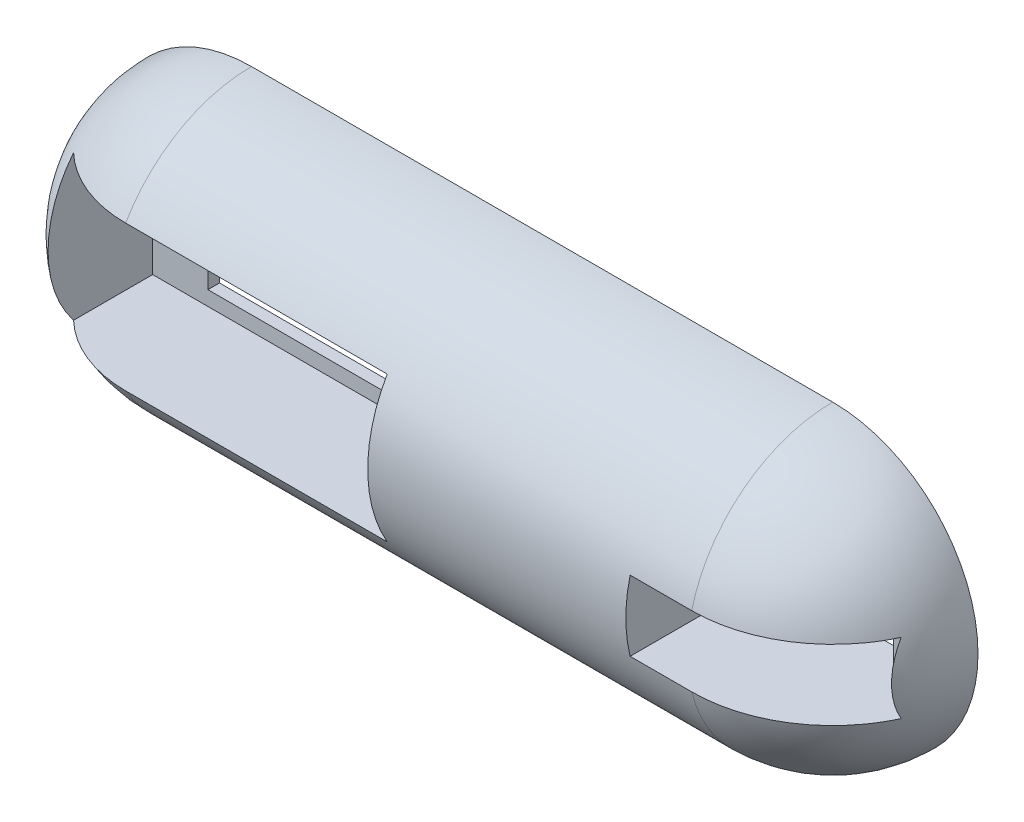
ISO-10303-21;
HEADER;
FILE_DESCRIPTION(('STEP AP214'),'2;1');
FILE_NAME('part.step','',(''),(''),'','','');
FILE_SCHEMA(('AUTOMOTIVE_DESIGN { 1 0 10303 214 1 1 1 1 }'));
ENDSEC;
DATA;
#1=APPLICATION_CONTEXT('core data for automotive mechanical design processes');
#2=APPLICATION_PROTOCOL_DEFINITION('international standard','automotive_design',2000,#1);
#3=PRODUCT_CONTEXT('',#1,'mechanical');
#4=PRODUCT('Part','Part','',(#3));
#5=PRODUCT_RELATED_PRODUCT_CATEGORY('part','',(#4));
#6=PRODUCT_DEFINITION_FORMATION('','',#4);
#7=PRODUCT_DEFINITION_CONTEXT('part definition',#1,'design');
#8=PRODUCT_DEFINITION('design','',#6,#7);
#9=PRODUCT_DEFINITION_SHAPE('','',#8);
#10=(LENGTH_UNIT() NAMED_UNIT(*) SI_UNIT(.MILLI.,.METRE.));
#11=(NAMED_UNIT(*) PLANE_ANGLE_UNIT() SI_UNIT($,.RADIAN.));
#12=(NAMED_UNIT(*) SI_UNIT($,.STERADIAN.) SOLID_ANGLE_UNIT());
#13=UNCERTAINTY_MEASURE_WITH_UNIT(LENGTH_MEASURE(1.E-05),#10,'distance_accuracy_value','');
#14=(GEOMETRIC_REPRESENTATION_CONTEXT(3) GLOBAL_UNCERTAINTY_ASSIGNED_CONTEXT((#13)) GLOBAL_UNIT_ASSIGNED_CONTEXT((#10,
#11,#12)) REPRESENTATION_CONTEXT('',''));
#15=CARTESIAN_POINT('',(0.,0.,0.));
#16=DIRECTION('',(0.,0.,1.));
#17=DIRECTION('',(1.,0.,0.));
#18=AXIS2_PLACEMENT_3D('',#15,#16,#17);
#19=CARTESIAN_POINT('',(-125.,0.,0.));
#20=DIRECTION('',(-1.,0.,0.));
#21=DIRECTION('',(0.,-1.,0.));
#22=AXIS2_PLACEMENT_3D('',#19,#20,#21);
#23=CYLINDRICAL_SURFACE('',#22,25.);
#24=CARTESIAN_POINT('',(-10.6,0.,0.));
#25=DIRECTION('',(-1.,0.,0.));
#26=DIRECTION('',(0.,0.,1.));
#27=AXIS2_PLACEMENT_3D('',#24,#25,#26);
#28=CIRCLE('',#27,25.);
#29=CARTESIAN_POINT('',(-10.6,-6.05000000000017,24.256906233071));
#30=VERTEX_POINT('',#29);
#31=CARTESIAN_POINT('',(-10.6,6.04999999999983,24.2569062330711));
#32=VERTEX_POINT('',#31);
#33=EDGE_CURVE('E65',#30,#32,#28,.T.);
#34=ORIENTED_EDGE('',*,*,#33,.T.);
#35=DIRECTION('',(-1.,0.,0.));
#36=VECTOR('',#35,1.);
#37=CARTESIAN_POINT('',(-125.,6.05000000000001,24.256906233071));
#38=LINE('',#37,#36);
#39=CARTESIAN_POINT('',(0.,6.05000000000001,24.256906233071));
#40=VERTEX_POINT('',#39);
#41=EDGE_CURVE('E445',#32,#40,#38,.F.);
#42=ORIENTED_EDGE('',*,*,#41,.T.);
#43=CARTESIAN_POINT('',(0.,0.,0.));
#44=DIRECTION('',(-1.,0.,0.));
#45=DIRECTION('',(0.,-1.,0.));
#46=AXIS2_PLACEMENT_3D('',#43,#44,#45);
#47=CIRCLE('',#46,25.);
#48=CARTESIAN_POINT('',(0.,25.,0.));
#49=VERTEX_POINT('',#48);
#50=EDGE_CURVE('E326',#40,#49,#47,.T.);
#51=ORIENTED_EDGE('',*,*,#50,.T.);
#52=DIRECTION('',(-1.,0.,0.));
#53=VECTOR('',#52,1.);
#54=CARTESIAN_POINT('',(-100.,25.,0.));
#55=LINE('',#54,#53);
#56=CARTESIAN_POINT('',(-100.,25.,0.));
#57=VERTEX_POINT('',#56);
#58=EDGE_CURVE('E309',#49,#57,#55,.T.);
#59=ORIENTED_EDGE('',*,*,#58,.T.);
#60=CARTESIAN_POINT('',(-100.,0.,0.));
#61=DIRECTION('',(-1.,0.,0.));
#62=DIRECTION('',(0.,-1.,0.));
#63=AXIS2_PLACEMENT_3D('',#60,#61,#62);
#64=CIRCLE('',#63,25.);
#65=CARTESIAN_POINT('',(-100.,12.4999999999998,21.6506350946111));
#66=VERTEX_POINT('',#65);
#67=EDGE_CURVE('E338',#66,#57,#64,.T.);
#68=ORIENTED_EDGE('',*,*,#67,.F.);
#69=DIRECTION('',(-1.,0.,0.));
#70=VECTOR('',#69,1.);
#71=CARTESIAN_POINT('',(-125.,12.4999999999998,21.6506350946111));
#72=LINE('',#71,#70);
#73=CARTESIAN_POINT('',(-55.,12.4999999999998,21.6506350946111));
#74=VERTEX_POINT('',#73);
#75=EDGE_CURVE('E316',#66,#74,#72,.F.);
#76=ORIENTED_EDGE('',*,*,#75,.T.);
#77=CARTESIAN_POINT('',(-55.,0.,0.));
#78=DIRECTION('',(1.,0.,0.));
#79=DIRECTION('',(0.,0.,-1.));
#80=AXIS2_PLACEMENT_3D('',#77,#78,#79);
#81=CIRCLE('',#80,25.);
#82=CARTESIAN_POINT('',(-55.,-12.5000000000002,21.6506350946109));
#83=VERTEX_POINT('',#82);
#84=EDGE_CURVE('E320',#74,#83,#81,.T.);
#85=ORIENTED_EDGE('',*,*,#84,.T.);
#86=DIRECTION('',(-1.,0.,0.));
#87=VECTOR('',#86,1.);
#88=CARTESIAN_POINT('',(-125.,-12.5000000000002,21.6506350946109));
#89=LINE('',#88,#87);
#90=CARTESIAN_POINT('',(-100.,-12.5000000000001,21.6506350946109));
#91=VERTEX_POINT('',#90);
#92=EDGE_CURVE('E322',#83,#91,#89,.T.);
#93=ORIENTED_EDGE('',*,*,#92,.T.);
#94=CARTESIAN_POINT('',(-100.,-25.,-1.74574066942157E-13));
#95=VERTEX_POINT('',#94);
#96=EDGE_CURVE('E334',#95,#91,#64,.T.);
#97=ORIENTED_EDGE('',*,*,#96,.F.);
#98=DIRECTION('',(-1.,0.,0.));
#99=VECTOR('',#98,1.);
#100=CARTESIAN_POINT('',(-100.,-25.,-1.74574066942157E-13));
#101=LINE('',#100,#99);
#102=CARTESIAN_POINT('',(0.,-25.,-1.74574066942157E-13));
#103=VERTEX_POINT('',#102);
#104=EDGE_CURVE('E339',#103,#95,#101,.T.);
#105=ORIENTED_EDGE('',*,*,#104,.F.);
#106=CARTESIAN_POINT('',(0.,-6.04999999999999,24.256906233071));
#107=VERTEX_POINT('',#106);
#108=EDGE_CURVE('E330',#103,#107,#47,.T.);
#109=ORIENTED_EDGE('',*,*,#108,.T.);
#110=DIRECTION('',(-1.,0.,0.));
#111=VECTOR('',#110,1.);
#112=CARTESIAN_POINT('',(-125.,-6.04999999999999,24.256906233071));
#113=LINE('',#112,#111);
#114=EDGE_CURVE('E409',#107,#30,#113,.T.);
#115=ORIENTED_EDGE('',*,*,#114,.T.);
#116=EDGE_LOOP('',(#34,#42,#51,#59,#68,#76,#85,#93,#97,#105,#109,#115));
#117=FACE_BOUND('',#116,.T.);
#118=ADVANCED_FACE('F56',(#117),#23,.T.);
#119=CARTESIAN_POINT('',(17.45,6.05000000000017,2.));
#120=DIRECTION('',(1.,0.,0.));
#121=DIRECTION('',(0.,0.,-1.));
#122=AXIS2_PLACEMENT_3D('',#119,#120,#121);
#123=PLANE('',#122);
#124=DIRECTION('',(0.,1.,0.));
#125=VECTOR('',#124,1.);
#126=CARTESIAN_POINT('',(17.45,6.04999999999995,7.00000000000004));
#127=LINE('',#126,#125);
#128=CARTESIAN_POINT('',(17.45,-6.04999999999987,6.99999999999996));
#129=VERTEX_POINT('',#128);
#130=CARTESIAN_POINT('',(17.45,6.04999999999995,7.00000000000004));
#131=VERTEX_POINT('',#130);
#132=EDGE_CURVE('E80',#129,#131,#127,.T.);
#133=ORIENTED_EDGE('',*,*,#132,.T.);
#134=DIRECTION('',(0.,0.,1.));
#135=VECTOR('',#134,1.);
#136=CARTESIAN_POINT('',(17.45,6.05000000000017,2.));
#137=LINE('',#136,#135);
#138=CARTESIAN_POINT('',(17.45,6.05000000000017,0.));
#139=VERTEX_POINT('',#138);
#140=EDGE_CURVE('E277',#139,#131,#137,.T.);
#141=ORIENTED_EDGE('',*,*,#140,.F.);
#142=DIRECTION('',(0.,-1.,0.));
#143=VECTOR('',#142,1.);
#144=CARTESIAN_POINT('',(17.45,0.,0.));
#145=LINE('',#144,#143);
#146=CARTESIAN_POINT('',(17.45,-6.04999999999987,0.));
#147=VERTEX_POINT('',#146);
#148=EDGE_CURVE('E214',#139,#147,#145,.T.);
#149=ORIENTED_EDGE('',*,*,#148,.T.);
#150=DIRECTION('',(0.,0.,1.));
#151=VECTOR('',#150,1.);
#152=CARTESIAN_POINT('',(17.45,-6.04999999999983,2.));
#153=LINE('',#152,#151);
#154=EDGE_CURVE('E72',#147,#129,#153,.T.);
#155=ORIENTED_EDGE('',*,*,#154,.T.);
#156=EDGE_LOOP('',(#133,#141,#149,#155));
#157=FACE_BOUND('',#156,.T.);
#158=ADVANCED_FACE('F473',(#157),#123,.F.);
#159=CARTESIAN_POINT('',(0.,0.,2.));
#160=DIRECTION('',(0.,0.,-1.));
#161=DIRECTION('',(0.,1.,0.));
#162=AXIS2_PLACEMENT_3D('',#159,#160,#161);
#163=PLANE('',#162);
#164=DIRECTION('',(0.,-1.,0.));
#165=VECTOR('',#164,1.);
#166=CARTESIAN_POINT('',(-55.,12.5,2.00000000000009));
#167=LINE('',#166,#165);
#168=CARTESIAN_POINT('',(-55.,12.5,2.00000000000009));
#169=VERTEX_POINT('',#168);
#170=CARTESIAN_POINT('',(-55.,-12.5,1.99999999999991));
#171=VERTEX_POINT('',#170);
#172=EDGE_CURVE('E371',#169,#171,#167,.T.);
#173=ORIENTED_EDGE('',*,*,#172,.F.);
#174=DIRECTION('',(1.,0.,0.));
#175=VECTOR('',#174,1.);
#176=CARTESIAN_POINT('',(-55.,12.5,2.00000000000009));
#177=LINE('',#176,#175);
#178=CARTESIAN_POINT('',(-115.,12.5,2.00000000000009));
#179=VERTEX_POINT('',#178);
#180=EDGE_CURVE('E364',#179,#169,#177,.T.);
#181=ORIENTED_EDGE('',*,*,#180,.F.);
#182=DIRECTION('',(0.,1.,0.));
#183=VECTOR('',#182,1.);
#184=CARTESIAN_POINT('',(-115.,12.5,2.00000000000009));
#185=LINE('',#184,#183);
#186=CARTESIAN_POINT('',(-115.,-12.5,1.99999999999991));
#187=VERTEX_POINT('',#186);
#188=EDGE_CURVE('E367',#187,#179,#185,.T.);
#189=ORIENTED_EDGE('',*,*,#188,.F.);
#190=DIRECTION('',(-1.,0.,0.));
#191=VECTOR('',#190,1.);
#192=CARTESIAN_POINT('',(-55.,-12.5,1.99999999999991));
#193=LINE('',#192,#191);
#194=EDGE_CURVE('E363',#171,#187,#193,.T.);
#195=ORIENTED_EDGE('',*,*,#194,.F.);
#196=EDGE_LOOP('',(#173,#181,#189,#195));
#197=FACE_BOUND('',#196,.T.);
#198=CARTESIAN_POINT('',(-109.5,4.99999999999765,2.));
#199=DIRECTION('',(0.,0.,1.));
#200=DIRECTION('',(1.,0.,0.));
#201=AXIS2_PLACEMENT_3D('',#198,#199,#200);
#202=CIRCLE('',#201,2.00000000000012);
#203=CARTESIAN_POINT('',(-107.5,4.99999999999765,2.));
#204=VERTEX_POINT('',#203);
#205=EDGE_CURVE('E402',#204,#204,#202,.T.);
#206=ORIENTED_EDGE('',*,*,#205,.F.);
#207=EDGE_LOOP('',(#206));
#208=FACE_BOUND('',#207,.T.);
#209=CARTESIAN_POINT('',(-109.5,-5.00000000000673,2.));
#210=DIRECTION('',(0.,0.,1.));
#211=DIRECTION('',(1.,0.,0.));
#212=AXIS2_PLACEMENT_3D('',#209,#210,#211);
#213=CIRCLE('',#212,2.00000000000044);
#214=CARTESIAN_POINT('',(-107.5,-5.00000000000673,2.));
#215=VERTEX_POINT('',#214);
#216=EDGE_CURVE('E397',#215,#215,#213,.T.);
#217=ORIENTED_EDGE('',*,*,#216,.F.);
#218=EDGE_LOOP('',(#217));
#219=FACE_BOUND('',#218,.T.);
#220=CARTESIAN_POINT('',(-61.5000000000004,-5.00000000000623,2.));
#221=DIRECTION('',(0.,0.,1.));
#222=DIRECTION('',(1.,0.,0.));
#223=AXIS2_PLACEMENT_3D('',#220,#221,#222);
#224=CIRCLE('',#223,2.00000000000034);
#225=CARTESIAN_POINT('',(-59.5,-5.00000000000623,2.));
#226=VERTEX_POINT('',#225);
#227=EDGE_CURVE('E392',#226,#226,#224,.T.);
#228=ORIENTED_EDGE('',*,*,#227,.F.);
#229=EDGE_LOOP('',(#228));
#230=FACE_BOUND('',#229,.T.);
#231=CARTESIAN_POINT('',(-61.5000000000005,4.99999999999815,2.));
#232=DIRECTION('',(0.,0.,1.));
#233=DIRECTION('',(1.,0.,0.));
#234=AXIS2_PLACEMENT_3D('',#231,#232,#233);
#235=CIRCLE('',#234,2.00000000000002);
#236=CARTESIAN_POINT('',(-59.5000000000005,4.99999999999815,2.));
#237=VERTEX_POINT('',#236);
#238=EDGE_CURVE('E294',#237,#237,#235,.T.);
#239=ORIENTED_EDGE('',*,*,#238,.F.);
#240=EDGE_LOOP('',(#239));
#241=FACE_BOUND('',#240,.T.);
#242=DIRECTION('',(1.,0.,0.));
#243=VECTOR('',#242,1.);
#244=CARTESIAN_POINT('',(-105.5,-9.99999999999892,2.));
#245=LINE('',#244,#243);
#246=CARTESIAN_POINT('',(-105.5,-9.99999999999892,2.));
#247=VERTEX_POINT('',#246);
#248=CARTESIAN_POINT('',(-65.5000000000002,-9.99999999999892,2.));
#249=VERTEX_POINT('',#248);
#250=EDGE_CURVE('E299',#247,#249,#245,.T.);
#251=ORIENTED_EDGE('',*,*,#250,.F.);
#252=DIRECTION('',(0.,-1.,0.));
#253=VECTOR('',#252,1.);
#254=CARTESIAN_POINT('',(-105.5,9.99999999999889,2.));
#255=LINE('',#254,#253);
#256=CARTESIAN_POINT('',(-105.5,9.99999999999889,2.));
#257=VERTEX_POINT('',#256);
#258=EDGE_CURVE('E413',#257,#247,#255,.T.);
#259=ORIENTED_EDGE('',*,*,#258,.F.);
#260=DIRECTION('',(1.,0.,0.));
#261=VECTOR('',#260,1.);
#262=CARTESIAN_POINT('',(-105.5,9.99999999999889,2.));
#263=LINE('',#262,#261);
#264=CARTESIAN_POINT('',(-65.5000000000002,9.99999999999889,2.));
#265=VERTEX_POINT('',#264);
#266=EDGE_CURVE('E289',#257,#265,#263,.T.);
#267=ORIENTED_EDGE('',*,*,#266,.T.);
#268=DIRECTION('',(0.,-1.,0.));
#269=VECTOR('',#268,1.);
#270=CARTESIAN_POINT('',(-65.5000000000002,9.99999999999889,2.));
#271=LINE('',#270,#269);
#272=EDGE_CURVE('E315',#265,#249,#271,.T.);
#273=ORIENTED_EDGE('',*,*,#272,.T.);
#274=EDGE_LOOP('',(#251,#259,#267,#273));
#275=FACE_BOUND('',#274,.T.);
#276=ADVANCED_FACE('F58',(#197,#208,#219,#230,#241,#275),#163,.F.);
#277=CARTESIAN_POINT('',(-100.,0.,0.));
#278=DIRECTION('',(-1.,0.,0.));
#279=DIRECTION('',(0.,-1.,0.));
#280=AXIS2_PLACEMENT_3D('',#277,#278,#279);
#281=SPHERICAL_SURFACE('',#280,25.);
#282=CARTESIAN_POINT('',(-115.,0.,0.));
#283=DIRECTION('',(-1.,0.,0.));
#284=DIRECTION('',(0.,0.,1.));
#285=AXIS2_PLACEMENT_3D('',#282,#283,#284);
#286=CIRCLE('',#285,20.);
#287=CARTESIAN_POINT('',(-115.,-12.5000000000001,15.6124949959959));
#288=VERTEX_POINT('',#287);
#289=CARTESIAN_POINT('',(-115.,12.4999999999999,15.6124949959961));
#290=VERTEX_POINT('',#289);
#291=EDGE_CURVE('E310',#288,#290,#286,.T.);
#292=ORIENTED_EDGE('',*,*,#291,.T.);
#293=CARTESIAN_POINT('',(-100.,12.5,0.));
#294=DIRECTION('',(0.,1.,0.));
#295=DIRECTION('',(0.,0.,1.));
#296=AXIS2_PLACEMENT_3D('',#293,#294,#295);
#297=CIRCLE('',#296,21.650635094611);
#298=EDGE_CURVE('E314',#290,#66,#297,.T.);
#299=ORIENTED_EDGE('',*,*,#298,.T.);
#300=ORIENTED_EDGE('',*,*,#67,.T.);
#301=CARTESIAN_POINT('',(-100.,0.,0.));
#302=DIRECTION('',(0.,0.,-1.));
#303=DIRECTION('',(1.,0.,0.));
#304=AXIS2_PLACEMENT_3D('',#301,#302,#303);
#305=CIRCLE('',#304,25.);
#306=EDGE_CURVE('E304',#95,#57,#305,.T.);
#307=ORIENTED_EDGE('',*,*,#306,.F.);
#308=ORIENTED_EDGE('',*,*,#96,.T.);
#309=CARTESIAN_POINT('',(-100.,-12.5,0.));
#310=DIRECTION('',(0.,-1.,0.));
#311=DIRECTION('',(0.,0.,-1.));
#312=AXIS2_PLACEMENT_3D('',#309,#310,#311);
#313=CIRCLE('',#312,21.650635094611);
#314=EDGE_CURVE('E321',#91,#288,#313,.T.);
#315=ORIENTED_EDGE('',*,*,#314,.T.);
#316=EDGE_LOOP('',(#292,#299,#300,#307,#308,#315));
#317=FACE_BOUND('',#316,.T.);
#318=ADVANCED_FACE('F480',(#317),#281,.T.);
#319=CARTESIAN_POINT('',(0.,0.,0.));
#320=DIRECTION('',(-1.,0.,0.));
#321=DIRECTION('',(0.,-1.,0.));
#322=AXIS2_PLACEMENT_3D('',#319,#320,#321);
#323=SPHERICAL_SURFACE('',#322,25.);
#324=CARTESIAN_POINT('',(0.,6.05000000000018,0.));
#325=DIRECTION('',(0.,1.,0.));
#326=DIRECTION('',(0.,0.,1.));
#327=AXIS2_PLACEMENT_3D('',#324,#325,#326);
#328=CIRCLE('',#327,24.256906233071);
#329=CARTESIAN_POINT('',(22.,6.04999999999993,10.2175094812778));
#330=VERTEX_POINT('',#329);
#331=EDGE_CURVE('E286',#40,#330,#328,.T.);
#332=ORIENTED_EDGE('',*,*,#331,.T.);
#333=CARTESIAN_POINT('',(22.,0.,0.));
#334=DIRECTION('',(1.,0.,0.));
#335=DIRECTION('',(0.,0.,-1.));
#336=AXIS2_PLACEMENT_3D('',#333,#334,#335);
#337=CIRCLE('',#336,11.8743420870379);
#338=CARTESIAN_POINT('',(22.,-6.05000000000007,10.2175094812777));
#339=VERTEX_POINT('',#338);
#340=EDGE_CURVE('E12',#330,#339,#337,.T.);
#341=ORIENTED_EDGE('',*,*,#340,.T.);
#342=CARTESIAN_POINT('',(0.,-6.04999999999982,0.));
#343=DIRECTION('',(0.,-1.,0.));
#344=DIRECTION('',(0.,0.,-1.));
#345=AXIS2_PLACEMENT_3D('',#342,#343,#344);
#346=CIRCLE('',#345,24.2569062330711);
#347=EDGE_CURVE('E269',#339,#107,#346,.T.);
#348=ORIENTED_EDGE('',*,*,#347,.T.);
#349=ORIENTED_EDGE('',*,*,#108,.F.);
#350=CARTESIAN_POINT('',(0.,0.,0.));
#351=DIRECTION('',(0.,0.,-1.));
#352=DIRECTION('',(1.,0.,0.));
#353=AXIS2_PLACEMENT_3D('',#350,#351,#352);
#354=CIRCLE('',#353,25.);
#355=EDGE_CURVE('E344',#49,#103,#354,.T.);
#356=ORIENTED_EDGE('',*,*,#355,.F.);
#357=ORIENTED_EDGE('',*,*,#50,.F.);
#358=EDGE_LOOP('',(#332,#341,#348,#349,#356,#357));
#359=FACE_BOUND('',#358,.T.);
#360=ADVANCED_FACE('F492',(#359),#323,.T.);
#361=CARTESIAN_POINT('',(-100.,0.,0.));
#362=DIRECTION('',(0.,0.,-1.));
#363=DIRECTION('',(1.,0.,0.));
#364=AXIS2_PLACEMENT_3D('',#361,#362,#363);
#365=PLANE('',#364);
#366=DIRECTION('',(0.,1.,0.));
#367=VECTOR('',#366,1.);
#368=CARTESIAN_POINT('',(-6.05,0.,0.));
#369=LINE('',#368,#367);
#370=CARTESIAN_POINT('',(-6.05,-6.04999999999987,0.));
#371=VERTEX_POINT('',#370);
#372=CARTESIAN_POINT('',(-6.05,6.05000000000017,0.));
#373=VERTEX_POINT('',#372);
#374=EDGE_CURVE('E201',#371,#373,#369,.T.);
#375=ORIENTED_EDGE('',*,*,#374,.F.);
#376=DIRECTION('',(-1.,0.,0.));
#377=VECTOR('',#376,1.);
#378=CARTESIAN_POINT('',(-100.,-6.04999999999987,0.));
#379=LINE('',#378,#377);
#380=EDGE_CURVE('E209',#147,#371,#379,.T.);
#381=ORIENTED_EDGE('',*,*,#380,.F.);
#382=ORIENTED_EDGE('',*,*,#148,.F.);
#383=DIRECTION('',(1.,0.,0.));
#384=VECTOR('',#383,1.);
#385=CARTESIAN_POINT('',(-100.,6.05000000000017,0.));
#386=LINE('',#385,#384);
#387=EDGE_CURVE('E219',#373,#139,#386,.T.);
#388=ORIENTED_EDGE('',*,*,#387,.F.);
#389=EDGE_LOOP('',(#375,#381,#382,#388));
#390=FACE_BOUND('',#389,.T.);
#391=CARTESIAN_POINT('',(-61.5000000000005,4.99999999999815,0.));
#392=DIRECTION('',(0.,0.,-1.));
#393=DIRECTION('',(0.,1.,0.));
#394=AXIS2_PLACEMENT_3D('',#391,#392,#393);
#395=CIRCLE('',#394,2.00000000000002);
#396=CARTESIAN_POINT('',(-61.5000000000005,6.99999999999818,0.));
#397=VERTEX_POINT('',#396);
#398=EDGE_CURVE('E388',#397,#397,#395,.T.);
#399=ORIENTED_EDGE('',*,*,#398,.F.);
#400=EDGE_LOOP('',(#399));
#401=FACE_BOUND('',#400,.T.);
#402=CARTESIAN_POINT('',(-61.5000000000004,-5.00000000000623,0.));
#403=DIRECTION('',(0.,0.,-1.));
#404=DIRECTION('',(0.,1.,0.));
#405=AXIS2_PLACEMENT_3D('',#402,#403,#404);
#406=CIRCLE('',#405,2.00000000000034);
#407=CARTESIAN_POINT('',(-61.5000000000004,-3.00000000000588,0.));
#408=VERTEX_POINT('',#407);
#409=EDGE_CURVE('E393',#408,#408,#406,.T.);
#410=ORIENTED_EDGE('',*,*,#409,.F.);
#411=EDGE_LOOP('',(#410));
#412=FACE_BOUND('',#411,.T.);
#413=CARTESIAN_POINT('',(-109.5,-5.00000000000673,0.));
#414=DIRECTION('',(0.,0.,-1.));
#415=DIRECTION('',(0.,1.,0.));
#416=AXIS2_PLACEMENT_3D('',#413,#414,#415);
#417=CIRCLE('',#416,2.00000000000044);
#418=CARTESIAN_POINT('',(-109.5,-3.00000000000628,0.));
#419=VERTEX_POINT('',#418);
#420=EDGE_CURVE('E398',#419,#419,#417,.T.);
#421=ORIENTED_EDGE('',*,*,#420,.F.);
#422=EDGE_LOOP('',(#421));
#423=FACE_BOUND('',#422,.T.);
#424=CARTESIAN_POINT('',(-109.5,4.99999999999765,0.));
#425=DIRECTION('',(0.,0.,-1.));
#426=DIRECTION('',(0.,1.,0.));
#427=AXIS2_PLACEMENT_3D('',#424,#425,#426);
#428=CIRCLE('',#427,2.00000000000012);
#429=CARTESIAN_POINT('',(-109.5,6.99999999999777,0.));
#430=VERTEX_POINT('',#429);
#431=EDGE_CURVE('E384',#430,#430,#428,.T.);
#432=ORIENTED_EDGE('',*,*,#431,.F.);
#433=EDGE_LOOP('',(#432));
#434=FACE_BOUND('',#433,.T.);
#435=DIRECTION('',(-1.,0.,0.));
#436=VECTOR('',#435,1.);
#437=CARTESIAN_POINT('',(-100.,-9.99999999999892,0.));
#438=LINE('',#437,#436);
#439=CARTESIAN_POINT('',(-65.5000000000002,-9.99999999999892,0.));
#440=VERTEX_POINT('',#439);
#441=CARTESIAN_POINT('',(-105.5,-9.99999999999892,0.));
#442=VERTEX_POINT('',#441);
#443=EDGE_CURVE('E290',#440,#442,#438,.T.);
#444=ORIENTED_EDGE('',*,*,#443,.F.);
#445=DIRECTION('',(0.,1.,0.));
#446=VECTOR('',#445,1.);
#447=CARTESIAN_POINT('',(-65.5000000000002,0.,0.));
#448=LINE('',#447,#446);
#449=CARTESIAN_POINT('',(-65.5000000000002,9.99999999999889,0.));
#450=VERTEX_POINT('',#449);
#451=EDGE_CURVE('E305',#440,#450,#448,.T.);
#452=ORIENTED_EDGE('',*,*,#451,.T.);
#453=DIRECTION('',(-1.,0.,0.));
#454=VECTOR('',#453,1.);
#455=CARTESIAN_POINT('',(-100.,9.99999999999889,0.));
#456=LINE('',#455,#454);
#457=CARTESIAN_POINT('',(-105.5,9.99999999999889,0.));
#458=VERTEX_POINT('',#457);
#459=EDGE_CURVE('E300',#450,#458,#456,.T.);
#460=ORIENTED_EDGE('',*,*,#459,.T.);
#461=DIRECTION('',(0.,1.,0.));
#462=VECTOR('',#461,1.);
#463=CARTESIAN_POINT('',(-105.5,0.,0.));
#464=LINE('',#463,#462);
#465=EDGE_CURVE('E295',#442,#458,#464,.T.);
#466=ORIENTED_EDGE('',*,*,#465,.F.);
#467=EDGE_LOOP('',(#444,#452,#460,#466));
#468=FACE_BOUND('',#467,.T.);
#469=ORIENTED_EDGE('',*,*,#306,.T.);
#470=ORIENTED_EDGE('',*,*,#58,.F.);
#471=ORIENTED_EDGE('',*,*,#355,.T.);
#472=ORIENTED_EDGE('',*,*,#104,.T.);
#473=EDGE_LOOP('',(#469,#470,#471,#472));
#474=FACE_BOUND('',#473,.T.);
#475=ADVANCED_FACE('F216',(#390,#401,#412,#423,#434,#468,#474),#365,.T.);
#476=CARTESIAN_POINT('',(-115.,12.4999999999998,25.0000000000003));
#477=DIRECTION('',(-1.,0.,0.));
#478=DIRECTION('',(0.,0.,1.));
#479=AXIS2_PLACEMENT_3D('',#476,#477,#478);
#480=PLANE('',#479);
#481=DIRECTION('',(0.,0.,-1.));
#482=VECTOR('',#481,1.);
#483=CARTESIAN_POINT('',(-115.,-12.5000000000002,25.0000000000001));
#484=LINE('',#483,#482);
#485=EDGE_CURVE('E343',#288,#187,#484,.T.);
#486=ORIENTED_EDGE('',*,*,#485,.T.);
#487=ORIENTED_EDGE('',*,*,#188,.T.);
#488=DIRECTION('',(0.,0.,-1.));
#489=VECTOR('',#488,1.);
#490=CARTESIAN_POINT('',(-115.,12.4999999999998,25.0000000000003));
#491=LINE('',#490,#489);
#492=EDGE_CURVE('E368',#290,#179,#491,.T.);
#493=ORIENTED_EDGE('',*,*,#492,.F.);
#494=ORIENTED_EDGE('',*,*,#291,.F.);
#495=EDGE_LOOP('',(#486,#487,#493,#494));
#496=FACE_BOUND('',#495,.T.);
#497=ADVANCED_FACE('F503',(#496),#480,.F.);
#498=CARTESIAN_POINT('',(-55.,12.4999999999998,25.0000000000003));
#499=DIRECTION('',(1.,0.,0.));
#500=DIRECTION('',(0.,0.,-1.));
#501=AXIS2_PLACEMENT_3D('',#498,#499,#500);
#502=PLANE('',#501);
#503=DIRECTION('',(0.,0.,-1.));
#504=VECTOR('',#503,1.);
#505=CARTESIAN_POINT('',(-55.,12.4999999999998,25.0000000000003));
#506=LINE('',#505,#504);
#507=EDGE_CURVE('E372',#74,#169,#506,.T.);
#508=ORIENTED_EDGE('',*,*,#507,.T.);
#509=ORIENTED_EDGE('',*,*,#172,.T.);
#510=DIRECTION('',(0.,0.,-1.));
#511=VECTOR('',#510,1.);
#512=CARTESIAN_POINT('',(-55.,-12.5000000000002,25.0000000000001));
#513=LINE('',#512,#511);
#514=EDGE_CURVE('E360',#83,#171,#513,.T.);
#515=ORIENTED_EDGE('',*,*,#514,.F.);
#516=ORIENTED_EDGE('',*,*,#84,.F.);
#517=EDGE_LOOP('',(#508,#509,#515,#516));
#518=FACE_BOUND('',#517,.T.);
#519=ADVANCED_FACE('F499',(#518),#502,.F.);
#520=CARTESIAN_POINT('',(-55.,12.4999999999998,25.0000000000003));
#521=DIRECTION('',(0.,1.,0.));
#522=DIRECTION('',(0.,0.,1.));
#523=AXIS2_PLACEMENT_3D('',#520,#521,#522);
#524=PLANE('',#523);
#525=ORIENTED_EDGE('',*,*,#492,.T.);
#526=ORIENTED_EDGE('',*,*,#180,.T.);
#527=ORIENTED_EDGE('',*,*,#507,.F.);
#528=ORIENTED_EDGE('',*,*,#75,.F.);
#529=ORIENTED_EDGE('',*,*,#298,.F.);
#530=EDGE_LOOP('',(#525,#526,#527,#528,#529));
#531=FACE_BOUND('',#530,.T.);
#532=ADVANCED_FACE('F502',(#531),#524,.F.);
#533=CARTESIAN_POINT('',(-55.,-12.5000000000002,25.0000000000001));
#534=DIRECTION('',(0.,-1.,0.));
#535=DIRECTION('',(0.,0.,-1.));
#536=AXIS2_PLACEMENT_3D('',#533,#534,#535);
#537=PLANE('',#536);
#538=ORIENTED_EDGE('',*,*,#92,.F.);
#539=ORIENTED_EDGE('',*,*,#514,.T.);
#540=ORIENTED_EDGE('',*,*,#194,.T.);
#541=ORIENTED_EDGE('',*,*,#485,.F.);
#542=ORIENTED_EDGE('',*,*,#314,.F.);
#543=EDGE_LOOP('',(#538,#539,#540,#541,#542));
#544=FACE_BOUND('',#543,.T.);
#545=ADVANCED_FACE('F505',(#544),#537,.F.);
#546=CARTESIAN_POINT('',(-109.5,4.99999999999765,-8.));
#547=DIRECTION('',(0.,0.,1.));
#548=DIRECTION('',(1.,0.,0.));
#549=AXIS2_PLACEMENT_3D('',#546,#547,#548);
#550=CYLINDRICAL_SURFACE('',#549,2.00000000000012);
#551=ORIENTED_EDGE('',*,*,#431,.T.);
#552=EDGE_LOOP('',(#551));
#553=FACE_BOUND('',#552,.T.);
#554=ORIENTED_EDGE('',*,*,#205,.T.);
#555=EDGE_LOOP('',(#554));
#556=FACE_BOUND('',#555,.T.);
#557=ADVANCED_FACE('F508',(#553,#556),#550,.F.);
#558=CARTESIAN_POINT('',(-109.5,-5.00000000000673,-8.));
#559=DIRECTION('',(0.,0.,1.));
#560=DIRECTION('',(1.,0.,0.));
#561=AXIS2_PLACEMENT_3D('',#558,#559,#560);
#562=CYLINDRICAL_SURFACE('',#561,2.00000000000044);
#563=ORIENTED_EDGE('',*,*,#420,.T.);
#564=EDGE_LOOP('',(#563));
#565=FACE_BOUND('',#564,.T.);
#566=ORIENTED_EDGE('',*,*,#216,.T.);
#567=EDGE_LOOP('',(#566));
#568=FACE_BOUND('',#567,.T.);
#569=ADVANCED_FACE('F538',(#565,#568),#562,.F.);
#570=CARTESIAN_POINT('',(-61.5000000000004,-5.00000000000623,-8.));
#571=DIRECTION('',(0.,0.,1.));
#572=DIRECTION('',(1.,0.,0.));
#573=AXIS2_PLACEMENT_3D('',#570,#571,#572);
#574=CYLINDRICAL_SURFACE('',#573,2.00000000000034);
#575=ORIENTED_EDGE('',*,*,#409,.T.);
#576=EDGE_LOOP('',(#575));
#577=FACE_BOUND('',#576,.T.);
#578=ORIENTED_EDGE('',*,*,#227,.T.);
#579=EDGE_LOOP('',(#578));
#580=FACE_BOUND('',#579,.T.);
#581=ADVANCED_FACE('F534',(#577,#580),#574,.F.);
#582=CARTESIAN_POINT('',(-61.5000000000005,4.99999999999815,-8.));
#583=DIRECTION('',(0.,0.,1.));
#584=DIRECTION('',(1.,0.,0.));
#585=AXIS2_PLACEMENT_3D('',#582,#583,#584);
#586=CYLINDRICAL_SURFACE('',#585,2.00000000000002);
#587=ORIENTED_EDGE('',*,*,#398,.T.);
#588=EDGE_LOOP('',(#587));
#589=FACE_BOUND('',#588,.T.);
#590=ORIENTED_EDGE('',*,*,#238,.T.);
#591=EDGE_LOOP('',(#590));
#592=FACE_BOUND('',#591,.T.);
#593=ADVANCED_FACE('F520',(#589,#592),#586,.F.);
#594=CARTESIAN_POINT('',(-105.5,-9.99999999999892,-8.));
#595=DIRECTION('',(0.,-1.,0.));
#596=DIRECTION('',(0.,0.,-1.));
#597=AXIS2_PLACEMENT_3D('',#594,#595,#596);
#598=PLANE('',#597);
#599=ORIENTED_EDGE('',*,*,#443,.T.);
#600=DIRECTION('',(0.,0.,1.));
#601=VECTOR('',#600,1.);
#602=CARTESIAN_POINT('',(-105.5,-9.99999999999892,-8.));
#603=LINE('',#602,#601);
#604=EDGE_CURVE('E293',#442,#247,#603,.T.);
#605=ORIENTED_EDGE('',*,*,#604,.T.);
#606=ORIENTED_EDGE('',*,*,#250,.T.);
#607=DIRECTION('',(0.,0.,1.));
#608=VECTOR('',#607,1.);
#609=CARTESIAN_POINT('',(-65.5000000000002,-9.99999999999892,-8.));
#610=LINE('',#609,#608);
#611=EDGE_CURVE('E406',#440,#249,#610,.T.);
#612=ORIENTED_EDGE('',*,*,#611,.F.);
#613=EDGE_LOOP('',(#599,#605,#606,#612));
#614=FACE_BOUND('',#613,.T.);
#615=ADVANCED_FACE('F516',(#614),#598,.F.);
#616=CARTESIAN_POINT('',(-105.5,9.99999999999889,-8.));
#617=DIRECTION('',(-1.,0.,0.));
#618=DIRECTION('',(0.,0.,1.));
#619=AXIS2_PLACEMENT_3D('',#616,#617,#618);
#620=PLANE('',#619);
#621=ORIENTED_EDGE('',*,*,#465,.T.);
#622=DIRECTION('',(0.,0.,1.));
#623=VECTOR('',#622,1.);
#624=CARTESIAN_POINT('',(-105.5,9.99999999999889,-8.));
#625=LINE('',#624,#623);
#626=EDGE_CURVE('E298',#458,#257,#625,.T.);
#627=ORIENTED_EDGE('',*,*,#626,.T.);
#628=ORIENTED_EDGE('',*,*,#258,.T.);
#629=ORIENTED_EDGE('',*,*,#604,.F.);
#630=EDGE_LOOP('',(#621,#627,#628,#629));
#631=FACE_BOUND('',#630,.T.);
#632=ADVANCED_FACE('F519',(#631),#620,.F.);
#633=CARTESIAN_POINT('',(-105.5,9.99999999999889,-8.));
#634=DIRECTION('',(0.,-1.,0.));
#635=DIRECTION('',(0.,0.,-1.));
#636=AXIS2_PLACEMENT_3D('',#633,#634,#635);
#637=PLANE('',#636);
#638=DIRECTION('',(0.,0.,1.));
#639=VECTOR('',#638,1.);
#640=CARTESIAN_POINT('',(-65.5000000000002,9.99999999999889,-8.));
#641=LINE('',#640,#639);
#642=EDGE_CURVE('E410',#450,#265,#641,.T.);
#643=ORIENTED_EDGE('',*,*,#642,.T.);
#644=ORIENTED_EDGE('',*,*,#266,.F.);
#645=ORIENTED_EDGE('',*,*,#626,.F.);
#646=ORIENTED_EDGE('',*,*,#459,.F.);
#647=EDGE_LOOP('',(#643,#644,#645,#646));
#648=FACE_BOUND('',#647,.T.);
#649=ADVANCED_FACE('F524',(#648),#637,.T.);
#650=CARTESIAN_POINT('',(-65.5000000000002,9.99999999999889,-8.));
#651=DIRECTION('',(-1.,0.,0.));
#652=DIRECTION('',(0.,0.,1.));
#653=AXIS2_PLACEMENT_3D('',#650,#651,#652);
#654=PLANE('',#653);
#655=ORIENTED_EDGE('',*,*,#611,.T.);
#656=ORIENTED_EDGE('',*,*,#272,.F.);
#657=ORIENTED_EDGE('',*,*,#642,.F.);
#658=ORIENTED_EDGE('',*,*,#451,.F.);
#659=EDGE_LOOP('',(#655,#656,#657,#658));
#660=FACE_BOUND('',#659,.T.);
#661=ADVANCED_FACE('F491',(#660),#654,.T.);
#662=CARTESIAN_POINT('',(-6.05,6.05000000000017,2.));
#663=DIRECTION('',(-1.,0.,0.));
#664=DIRECTION('',(0.,0.,1.));
#665=AXIS2_PLACEMENT_3D('',#662,#663,#664);
#666=PLANE('',#665);
#667=DIRECTION('',(0.,0.,1.));
#668=VECTOR('',#667,1.);
#669=CARTESIAN_POINT('',(-6.05,6.05000000000017,2.));
#670=LINE('',#669,#668);
#671=CARTESIAN_POINT('',(-6.05,6.04999999999995,7.00000000000004));
#672=VERTEX_POINT('',#671);
#673=EDGE_CURVE('E274',#373,#672,#670,.T.);
#674=ORIENTED_EDGE('',*,*,#673,.T.);
#675=DIRECTION('',(0.,-1.,0.));
#676=VECTOR('',#675,1.);
#677=CARTESIAN_POINT('',(-6.05,6.04999999999995,7.00000000000004));
#678=LINE('',#677,#676);
#679=CARTESIAN_POINT('',(-6.05,-6.05000000000005,6.99999999999996));
#680=VERTEX_POINT('',#679);
#681=EDGE_CURVE('E203',#672,#680,#678,.T.);
#682=ORIENTED_EDGE('',*,*,#681,.T.);
#683=DIRECTION('',(0.,0.,1.));
#684=VECTOR('',#683,1.);
#685=CARTESIAN_POINT('',(-6.05,-6.04999999999983,2.));
#686=LINE('',#685,#684);
#687=EDGE_CURVE('E197',#371,#680,#686,.T.);
#688=ORIENTED_EDGE('',*,*,#687,.F.);
#689=ORIENTED_EDGE('',*,*,#374,.T.);
#690=EDGE_LOOP('',(#674,#682,#688,#689));
#691=FACE_BOUND('',#690,.T.);
#692=ADVANCED_FACE('F199',(#691),#666,.F.);
#693=CARTESIAN_POINT('',(-6.05,6.05000000000017,2.));
#694=DIRECTION('',(0.,1.,0.));
#695=DIRECTION('',(0.,0.,1.));
#696=AXIS2_PLACEMENT_3D('',#693,#694,#695);
#697=PLANE('',#696);
#698=ORIENTED_EDGE('',*,*,#41,.F.);
#699=DIRECTION('',(0.,0.,-1.));
#700=VECTOR('',#699,1.);
#701=CARTESIAN_POINT('',(-10.6,6.04999999999983,25.0000000000002));
#702=LINE('',#701,#700);
#703=CARTESIAN_POINT('',(-10.6,6.04999999999995,7.00000000000004));
#704=VERTEX_POINT('',#703);
#705=EDGE_CURVE('E234',#32,#704,#702,.T.);
#706=ORIENTED_EDGE('',*,*,#705,.T.);
#707=DIRECTION('',(1.,0.,0.));
#708=VECTOR('',#707,1.);
#709=CARTESIAN_POINT('',(-10.6,6.04999999999995,7.00000000000004));
#710=LINE('',#709,#708);
#711=EDGE_CURVE('E256',#704,#672,#710,.T.);
#712=ORIENTED_EDGE('',*,*,#711,.T.);
#713=ORIENTED_EDGE('',*,*,#673,.F.);
#714=ORIENTED_EDGE('',*,*,#387,.T.);
#715=ORIENTED_EDGE('',*,*,#140,.T.);
#716=DIRECTION('',(1.,0.,0.));
#717=VECTOR('',#716,1.);
#718=CARTESIAN_POINT('',(22.,6.04999999999995,7.00000000000004));
#719=LINE('',#718,#717);
#720=CARTESIAN_POINT('',(22.,6.04999999999995,7.00000000000004));
#721=VERTEX_POINT('',#720);
#722=EDGE_CURVE('E229',#131,#721,#719,.T.);
#723=ORIENTED_EDGE('',*,*,#722,.T.);
#724=DIRECTION('',(0.,0.,-1.));
#725=VECTOR('',#724,1.);
#726=CARTESIAN_POINT('',(22.,6.04999999999983,25.0000000000002));
#727=LINE('',#726,#725);
#728=EDGE_CURVE('E243',#330,#721,#727,.T.);
#729=ORIENTED_EDGE('',*,*,#728,.F.);
#730=ORIENTED_EDGE('',*,*,#331,.F.);
#731=EDGE_LOOP('',(#698,#706,#712,#713,#714,#715,#723,#729,#730));
#732=FACE_BOUND('',#731,.T.);
#733=ADVANCED_FACE('F463',(#732),#697,.F.);
#734=CARTESIAN_POINT('',(-6.05,-6.04999999999983,2.));
#735=DIRECTION('',(0.,-1.,0.));
#736=DIRECTION('',(0.,0.,-1.));
#737=AXIS2_PLACEMENT_3D('',#734,#735,#736);
#738=PLANE('',#737);
#739=ORIENTED_EDGE('',*,*,#154,.F.);
#740=ORIENTED_EDGE('',*,*,#380,.T.);
#741=ORIENTED_EDGE('',*,*,#687,.T.);
#742=DIRECTION('',(-1.,0.,0.));
#743=VECTOR('',#742,1.);
#744=CARTESIAN_POINT('',(-6.05,-6.05000000000005,6.99999999999996));
#745=LINE('',#744,#743);
#746=CARTESIAN_POINT('',(-10.6,-6.05000000000005,6.99999999999996));
#747=VERTEX_POINT('',#746);
#748=EDGE_CURVE('E224',#680,#747,#745,.T.);
#749=ORIENTED_EDGE('',*,*,#748,.T.);
#750=DIRECTION('',(0.,0.,-1.));
#751=VECTOR('',#750,1.);
#752=CARTESIAN_POINT('',(-10.6,-6.05000000000017,25.0000000000001));
#753=LINE('',#752,#751);
#754=EDGE_CURVE('E260',#30,#747,#753,.T.);
#755=ORIENTED_EDGE('',*,*,#754,.F.);
#756=ORIENTED_EDGE('',*,*,#114,.F.);
#757=ORIENTED_EDGE('',*,*,#347,.F.);
#758=DIRECTION('',(0.,0.,-1.));
#759=VECTOR('',#758,1.);
#760=CARTESIAN_POINT('',(22.,-6.05000000000017,25.0000000000001));
#761=LINE('',#760,#759);
#762=CARTESIAN_POINT('',(22.,-6.05000000000005,6.99999999999996));
#763=VERTEX_POINT('',#762);
#764=EDGE_CURVE('E244',#339,#763,#761,.T.);
#765=ORIENTED_EDGE('',*,*,#764,.T.);
#766=DIRECTION('',(-1.,0.,0.));
#767=VECTOR('',#766,1.);
#768=CARTESIAN_POINT('',(17.45,-6.05000000000005,6.99999999999996));
#769=LINE('',#768,#767);
#770=EDGE_CURVE('E238',#763,#129,#769,.T.);
#771=ORIENTED_EDGE('',*,*,#770,.T.);
#772=EDGE_LOOP('',(#739,#740,#741,#749,#755,#756,#757,#765,#771));
#773=FACE_BOUND('',#772,.T.);
#774=ADVANCED_FACE('F210',(#773),#738,.F.);
#775=CARTESIAN_POINT('',(22.,-6.05000000000017,25.0000000000001));
#776=DIRECTION('',(1.,0.,0.));
#777=DIRECTION('',(0.,0.,-1.));
#778=AXIS2_PLACEMENT_3D('',#775,#776,#777);
#779=PLANE('',#778);
#780=ORIENTED_EDGE('',*,*,#728,.T.);
#781=DIRECTION('',(0.,-1.,0.));
#782=VECTOR('',#781,1.);
#783=CARTESIAN_POINT('',(22.,-6.05000000000005,6.99999999999996));
#784=LINE('',#783,#782);
#785=EDGE_CURVE('E233',#721,#763,#784,.T.);
#786=ORIENTED_EDGE('',*,*,#785,.T.);
#787=ORIENTED_EDGE('',*,*,#764,.F.);
#788=ORIENTED_EDGE('',*,*,#340,.F.);
#789=EDGE_LOOP('',(#780,#786,#787,#788));
#790=FACE_BOUND('',#789,.T.);
#791=ADVANCED_FACE('F488',(#790),#779,.F.);
#792=CARTESIAN_POINT('',(0.,0.,7.));
#793=DIRECTION('',(0.,0.,1.));
#794=DIRECTION('',(0.,-1.,0.));
#795=AXIS2_PLACEMENT_3D('',#792,#793,#794);
#796=PLANE('',#795);
#797=ORIENTED_EDGE('',*,*,#722,.F.);
#798=ORIENTED_EDGE('',*,*,#132,.F.);
#799=ORIENTED_EDGE('',*,*,#770,.F.);
#800=ORIENTED_EDGE('',*,*,#785,.F.);
#801=EDGE_LOOP('',(#797,#798,#799,#800));
#802=FACE_BOUND('',#801,.T.);
#803=CARTESIAN_POINT('',(19.95,1.16992791158857E-13,7.));
#804=DIRECTION('',(0.,0.,1.));
#805=DIRECTION('',(0.,-1.,0.));
#806=AXIS2_PLACEMENT_3D('',#803,#804,#805);
#807=CIRCLE('',#806,1.);
#808=CARTESIAN_POINT('',(19.95,-0.999999999999884,6.99999999999999));
#809=VERTEX_POINT('',#808);
#810=EDGE_CURVE('E247',#809,#809,#807,.F.);
#811=ORIENTED_EDGE('',*,*,#810,.T.);
#812=EDGE_LOOP('',(#811));
#813=FACE_BOUND('',#812,.T.);
#814=ADVANCED_FACE('F619',(#802,#813),#796,.T.);
#815=CARTESIAN_POINT('',(-10.6,-6.05000000000017,25.0000000000001));
#816=DIRECTION('',(-1.,0.,0.));
#817=DIRECTION('',(0.,0.,1.));
#818=AXIS2_PLACEMENT_3D('',#815,#816,#817);
#819=PLANE('',#818);
#820=ORIENTED_EDGE('',*,*,#33,.F.);
#821=ORIENTED_EDGE('',*,*,#754,.T.);
#822=DIRECTION('',(0.,1.,0.));
#823=VECTOR('',#822,1.);
#824=CARTESIAN_POINT('',(-10.6,-6.05000000000005,6.99999999999996));
#825=LINE('',#824,#823);
#826=EDGE_CURVE('E252',#747,#704,#825,.T.);
#827=ORIENTED_EDGE('',*,*,#826,.T.);
#828=ORIENTED_EDGE('',*,*,#705,.F.);
#829=EDGE_LOOP('',(#820,#821,#827,#828));
#830=FACE_BOUND('',#829,.T.);
#831=ADVANCED_FACE('F465',(#830),#819,.F.);
#832=CARTESIAN_POINT('',(0.,0.,7.));
#833=DIRECTION('',(0.,0.,-1.));
#834=DIRECTION('',(0.,1.,0.));
#835=AXIS2_PLACEMENT_3D('',#832,#833,#834);
#836=PLANE('',#835);
#837=ORIENTED_EDGE('',*,*,#681,.F.);
#838=ORIENTED_EDGE('',*,*,#711,.F.);
#839=ORIENTED_EDGE('',*,*,#826,.F.);
#840=ORIENTED_EDGE('',*,*,#748,.F.);
#841=EDGE_LOOP('',(#837,#838,#839,#840));
#842=FACE_BOUND('',#841,.T.);
#843=CARTESIAN_POINT('',(-8.55,1.16992791158857E-13,7.));
#844=DIRECTION('',(0.,0.,-1.));
#845=DIRECTION('',(0.,1.,0.));
#846=AXIS2_PLACEMENT_3D('',#843,#844,#845);
#847=CIRCLE('',#846,0.999999999999998);
#848=CARTESIAN_POINT('',(-8.55,1.00000000000012,7.00000000000001));
#849=VERTEX_POINT('',#848);
#850=EDGE_CURVE('E206',#849,#849,#847,.F.);
#851=ORIENTED_EDGE('',*,*,#850,.F.);
#852=EDGE_LOOP('',(#851));
#853=FACE_BOUND('',#852,.T.);
#854=ADVANCED_FACE('F469',(#842,#853),#836,.F.);
#855=CARTESIAN_POINT('',(19.95,1.51907604547288E-13,2.));
#856=DIRECTION('',(0.,0.,-1.));
#857=DIRECTION('',(-1.,0.,0.));
#858=AXIS2_PLACEMENT_3D('',#855,#856,#857);
#859=PLANE('',#858);
#860=CARTESIAN_POINT('',(19.95,1.51907604547288E-13,2.));
#861=DIRECTION('',(0.,0.,1.));
#862=DIRECTION('',(-1.,0.,0.));
#863=AXIS2_PLACEMENT_3D('',#860,#861,#862);
#864=CIRCLE('',#863,1.);
#865=CARTESIAN_POINT('',(18.95,1.51907604547288E-13,2.));
#866=VERTEX_POINT('',#865);
#867=EDGE_CURVE('E270',#866,#866,#864,.T.);
#868=ORIENTED_EDGE('',*,*,#867,.T.);
#869=EDGE_LOOP('',(#868));
#870=FACE_BOUND('',#869,.T.);
#871=ADVANCED_FACE('F639',(#870),#859,.F.);
#872=CARTESIAN_POINT('',(19.95,1.51907604547288E-13,2.));
#873=DIRECTION('',(0.,0.,1.));
#874=DIRECTION('',(0.,-1.,0.));
#875=AXIS2_PLACEMENT_3D('',#872,#873,#874);
#876=CYLINDRICAL_SURFACE('',#875,1.);
#877=ORIENTED_EDGE('',*,*,#867,.F.);
#878=EDGE_LOOP('',(#877));
#879=FACE_BOUND('',#878,.T.);
#880=ORIENTED_EDGE('',*,*,#810,.F.);
#881=EDGE_LOOP('',(#880));
#882=FACE_BOUND('',#881,.T.);
#883=ADVANCED_FACE('F647',(#879,#882),#876,.F.);
#884=CARTESIAN_POINT('',(-8.55,1.51907604547288E-13,2.));
#885=DIRECTION('',(0.,0.,1.));
#886=DIRECTION('',(1.,0.,0.));
#887=AXIS2_PLACEMENT_3D('',#884,#885,#886);
#888=PLANE('',#887);
#889=CARTESIAN_POINT('',(-8.55,1.51907604547288E-13,2.));
#890=DIRECTION('',(0.,0.,1.));
#891=DIRECTION('',(1.,0.,0.));
#892=AXIS2_PLACEMENT_3D('',#889,#890,#891);
#893=CIRCLE('',#892,0.999999999999998);
#894=CARTESIAN_POINT('',(-7.55,1.51907604547288E-13,2.));
#895=VERTEX_POINT('',#894);
#896=EDGE_CURVE('E265',#895,#895,#893,.T.);
#897=ORIENTED_EDGE('',*,*,#896,.T.);
#898=EDGE_LOOP('',(#897));
#899=FACE_BOUND('',#898,.T.);
#900=ADVANCED_FACE('F655',(#899),#888,.T.);
#901=CARTESIAN_POINT('',(-8.55,1.51907604547288E-13,2.));
#902=DIRECTION('',(0.,0.,1.));
#903=DIRECTION('',(0.,-1.,0.));
#904=AXIS2_PLACEMENT_3D('',#901,#902,#903);
#905=CYLINDRICAL_SURFACE('',#904,0.999999999999998);
#906=ORIENTED_EDGE('',*,*,#850,.T.);
#907=EDGE_LOOP('',(#906));
#908=FACE_BOUND('',#907,.T.);
#909=ORIENTED_EDGE('',*,*,#896,.F.);
#910=EDGE_LOOP('',(#909));
#911=FACE_BOUND('',#910,.T.);
#912=ADVANCED_FACE('F662',(#908,#911),#905,.F.);
#913=CLOSED_SHELL('',(#118,#158,#276,#318,#360,#475,#497,#519,#532,#545,#557,#569,#581,#593,
#615,#632,#649,#661,#692,#733,#774,#791,#814,#831,#854,#871,#883,#900,#912));
#914=MANIFOLD_SOLID_BREP('B2',#913);
#915=ADVANCED_BREP_SHAPE_REPRESENTATION('',(#18,#914),#14);
#916=SHAPE_DEFINITION_REPRESENTATION(#9,#915);
ENDSEC;
END-ISO-10303-21;
